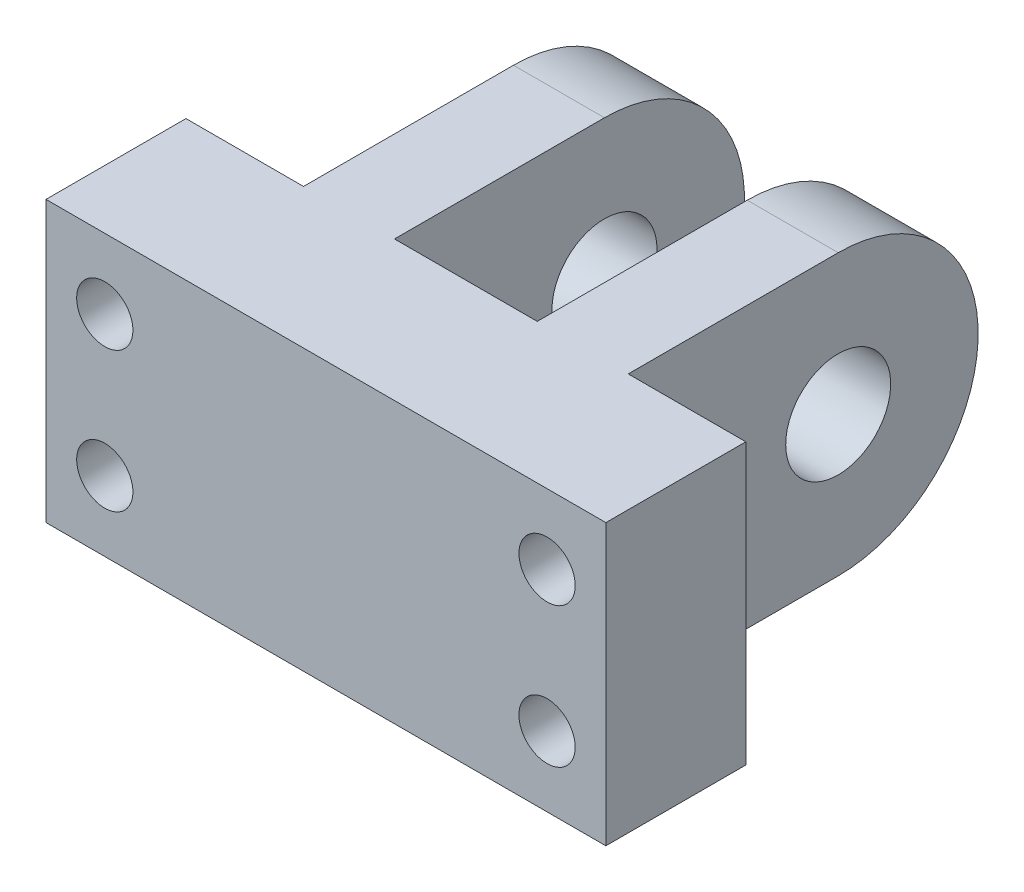
ISO-10303-21;
HEADER;
FILE_DESCRIPTION(('STEP AP214'),'2;1');
FILE_NAME('part.step','',(''),(''),'','','');
FILE_SCHEMA(('AUTOMOTIVE_DESIGN { 1 0 10303 214 1 1 1 1 }'));
ENDSEC;
DATA;
#1=APPLICATION_CONTEXT('core data for automotive mechanical design processes');
#2=APPLICATION_PROTOCOL_DEFINITION('international standard','automotive_design',2000,#1);
#3=PRODUCT_CONTEXT('',#1,'mechanical');
#4=PRODUCT('Part','Part','',(#3));
#5=PRODUCT_RELATED_PRODUCT_CATEGORY('part','',(#4));
#6=PRODUCT_DEFINITION_FORMATION('','',#4);
#7=PRODUCT_DEFINITION_CONTEXT('part definition',#1,'design');
#8=PRODUCT_DEFINITION('design','',#6,#7);
#9=PRODUCT_DEFINITION_SHAPE('','',#8);
#10=(LENGTH_UNIT() NAMED_UNIT(*) SI_UNIT(.MILLI.,.METRE.));
#11=(NAMED_UNIT(*) PLANE_ANGLE_UNIT() SI_UNIT($,.RADIAN.));
#12=(NAMED_UNIT(*) SI_UNIT($,.STERADIAN.) SOLID_ANGLE_UNIT());
#13=UNCERTAINTY_MEASURE_WITH_UNIT(LENGTH_MEASURE(1.E-05),#10,'distance_accuracy_value','');
#14=(GEOMETRIC_REPRESENTATION_CONTEXT(3) GLOBAL_UNCERTAINTY_ASSIGNED_CONTEXT((#13)) GLOBAL_UNIT_ASSIGNED_CONTEXT((#10,
#11,#12)) REPRESENTATION_CONTEXT('',''));
#15=CARTESIAN_POINT('',(0.,0.,0.));
#16=DIRECTION('',(0.,0.,1.));
#17=DIRECTION('',(1.,0.,0.));
#18=AXIS2_PLACEMENT_3D('',#15,#16,#17);
#19=CARTESIAN_POINT('',(50.8,12.7,-31.75));
#20=DIRECTION('',(-1.,0.,0.));
#21=DIRECTION('',(0.,0.,1.));
#22=AXIS2_PLACEMENT_3D('',#19,#20,#21);
#23=CYLINDRICAL_SURFACE('',#22,12.7);
#24=DIRECTION('',(-1.,0.,0.));
#25=VECTOR('',#24,1.);
#26=CARTESIAN_POINT('',(50.8,0.,-31.75));
#27=LINE('',#26,#25);
#28=CARTESIAN_POINT('',(18.923,0.,-31.75));
#29=VERTEX_POINT('',#28);
#30=CARTESIAN_POINT('',(10.668,0.,-31.75));
#31=VERTEX_POINT('',#30);
#32=EDGE_CURVE('E170',#29,#31,#27,.T.);
#33=ORIENTED_EDGE('',*,*,#32,.T.);
#34=CARTESIAN_POINT('',(10.668,12.7,-31.75));
#35=DIRECTION('',(1.,0.,0.));
#36=DIRECTION('',(0.,0.,-1.));
#37=AXIS2_PLACEMENT_3D('',#34,#35,#36);
#38=CIRCLE('',#37,12.7);
#39=CARTESIAN_POINT('',(10.668,25.4,-31.75));
#40=VERTEX_POINT('',#39);
#41=EDGE_CURVE('E162',#31,#40,#38,.T.);
#42=ORIENTED_EDGE('',*,*,#41,.T.);
#43=DIRECTION('',(-1.,0.,0.));
#44=VECTOR('',#43,1.);
#45=CARTESIAN_POINT('',(50.8,25.4,-31.75));
#46=LINE('',#45,#44);
#47=CARTESIAN_POINT('',(18.923,25.4,-31.75));
#48=VERTEX_POINT('',#47);
#49=EDGE_CURVE('E152',#48,#40,#46,.T.);
#50=ORIENTED_EDGE('',*,*,#49,.F.);
#51=CARTESIAN_POINT('',(18.923,12.7,-31.75));
#52=DIRECTION('',(-1.,0.,0.));
#53=DIRECTION('',(0.,0.,1.));
#54=AXIS2_PLACEMENT_3D('',#51,#52,#53);
#55=CIRCLE('',#54,12.7);
#56=EDGE_CURVE('E183',#48,#29,#55,.T.);
#57=ORIENTED_EDGE('',*,*,#56,.T.);
#58=EDGE_LOOP('',(#33,#42,#50,#57));
#59=FACE_BOUND('',#58,.T.);
#60=ADVANCED_FACE('F32',(#59),#23,.T.);
#61=CARTESIAN_POINT('',(50.8,12.7,-31.75));
#62=DIRECTION('',(-1.,0.,0.));
#63=DIRECTION('',(0.,0.,1.));
#64=AXIS2_PLACEMENT_3D('',#61,#62,#63);
#65=PLANE('',#64);
#66=DIRECTION('',(0.,0.,-1.));
#67=VECTOR('',#66,1.);
#68=CARTESIAN_POINT('',(50.8,0.,0.));
#69=LINE('',#68,#67);
#70=CARTESIAN_POINT('',(50.8,0.,0.));
#71=VERTEX_POINT('',#70);
#72=CARTESIAN_POINT('',(50.8,0.,-12.7));
#73=VERTEX_POINT('',#72);
#74=EDGE_CURVE('E144',#71,#73,#69,.T.);
#75=ORIENTED_EDGE('',*,*,#74,.T.);
#76=DIRECTION('',(0.,-1.,0.));
#77=VECTOR('',#76,1.);
#78=CARTESIAN_POINT('',(50.8,25.4,-12.7));
#79=LINE('',#78,#77);
#80=CARTESIAN_POINT('',(50.8,25.4,-12.7));
#81=VERTEX_POINT('',#80);
#82=EDGE_CURVE('E129',#81,#73,#79,.T.);
#83=ORIENTED_EDGE('',*,*,#82,.F.);
#84=DIRECTION('',(0.,0.,1.));
#85=VECTOR('',#84,1.);
#86=CARTESIAN_POINT('',(50.8,25.4,0.));
#87=LINE('',#86,#85);
#88=CARTESIAN_POINT('',(50.8,25.4,0.));
#89=VERTEX_POINT('',#88);
#90=EDGE_CURVE('E142',#81,#89,#87,.T.);
#91=ORIENTED_EDGE('',*,*,#90,.T.);
#92=DIRECTION('',(0.,-1.,0.));
#93=VECTOR('',#92,1.);
#94=CARTESIAN_POINT('',(50.8,0.,0.));
#95=LINE('',#94,#93);
#96=EDGE_CURVE('E154',#89,#71,#95,.T.);
#97=ORIENTED_EDGE('',*,*,#96,.T.);
#98=EDGE_LOOP('',(#75,#83,#91,#97));
#99=FACE_BOUND('',#98,.T.);
#100=ADVANCED_FACE('F140',(#99),#65,.F.);
#101=CARTESIAN_POINT('',(0.,12.7,-31.75));
#102=DIRECTION('',(-1.,0.,0.));
#103=DIRECTION('',(0.,0.,1.));
#104=AXIS2_PLACEMENT_3D('',#101,#102,#103);
#105=PLANE('',#104);
#106=DIRECTION('',(0.,-1.,0.));
#107=VECTOR('',#106,1.);
#108=CARTESIAN_POINT('',(0.,25.4,-12.7));
#109=LINE('',#108,#107);
#110=CARTESIAN_POINT('',(0.,25.4,-12.7));
#111=VERTEX_POINT('',#110);
#112=CARTESIAN_POINT('',(0.,0.,-12.7));
#113=VERTEX_POINT('',#112);
#114=EDGE_CURVE('E177',#111,#113,#109,.T.);
#115=ORIENTED_EDGE('',*,*,#114,.T.);
#116=DIRECTION('',(0.,0.,-1.));
#117=VECTOR('',#116,1.);
#118=CARTESIAN_POINT('',(0.,0.,0.));
#119=LINE('',#118,#117);
#120=CARTESIAN_POINT('',(0.,0.,0.));
#121=VERTEX_POINT('',#120);
#122=EDGE_CURVE('E161',#121,#113,#119,.T.);
#123=ORIENTED_EDGE('',*,*,#122,.F.);
#124=DIRECTION('',(0.,-1.,0.));
#125=VECTOR('',#124,1.);
#126=CARTESIAN_POINT('',(0.,0.,0.));
#127=LINE('',#126,#125);
#128=CARTESIAN_POINT('',(0.,25.4,0.));
#129=VERTEX_POINT('',#128);
#130=EDGE_CURVE('E158',#129,#121,#127,.T.);
#131=ORIENTED_EDGE('',*,*,#130,.F.);
#132=DIRECTION('',(0.,0.,1.));
#133=VECTOR('',#132,1.);
#134=CARTESIAN_POINT('',(0.,25.4,0.));
#135=LINE('',#134,#133);
#136=EDGE_CURVE('E165',#111,#129,#135,.T.);
#137=ORIENTED_EDGE('',*,*,#136,.F.);
#138=EDGE_LOOP('',(#115,#123,#131,#137));
#139=FACE_BOUND('',#138,.T.);
#140=ADVANCED_FACE('F248',(#139),#105,.T.);
#141=CARTESIAN_POINT('',(50.8,0.,0.));
#142=DIRECTION('',(0.,0.,-1.));
#143=DIRECTION('',(-1.,0.,0.));
#144=AXIS2_PLACEMENT_3D('',#141,#142,#143);
#145=PLANE('',#144);
#146=CARTESIAN_POINT('',(45.466,6.34999999999999,0.));
#147=DIRECTION('',(0.,0.,-1.));
#148=DIRECTION('',(0.,1.,0.));
#149=AXIS2_PLACEMENT_3D('',#146,#147,#148);
#150=CIRCLE('',#149,2.5527);
#151=CARTESIAN_POINT('',(45.466,8.90269999999999,0.));
#152=VERTEX_POINT('',#151);
#153=EDGE_CURVE('E369',#152,#152,#150,.T.);
#154=ORIENTED_EDGE('',*,*,#153,.T.);
#155=EDGE_LOOP('',(#154));
#156=FACE_BOUND('',#155,.T.);
#157=CARTESIAN_POINT('',(45.466,19.05,0.));
#158=DIRECTION('',(0.,0.,-1.));
#159=DIRECTION('',(0.,1.,0.));
#160=AXIS2_PLACEMENT_3D('',#157,#158,#159);
#161=CIRCLE('',#160,2.5527);
#162=CARTESIAN_POINT('',(45.466,21.6027,0.));
#163=VERTEX_POINT('',#162);
#164=EDGE_CURVE('E381',#163,#163,#161,.T.);
#165=ORIENTED_EDGE('',*,*,#164,.T.);
#166=EDGE_LOOP('',(#165));
#167=FACE_BOUND('',#166,.T.);
#168=CARTESIAN_POINT('',(5.334,19.05,0.));
#169=DIRECTION('',(0.,0.,-1.));
#170=DIRECTION('',(0.,1.,0.));
#171=AXIS2_PLACEMENT_3D('',#168,#169,#170);
#172=CIRCLE('',#171,2.5527);
#173=CARTESIAN_POINT('',(5.334,21.6027,0.));
#174=VERTEX_POINT('',#173);
#175=EDGE_CURVE('E393',#174,#174,#172,.T.);
#176=ORIENTED_EDGE('',*,*,#175,.T.);
#177=EDGE_LOOP('',(#176));
#178=FACE_BOUND('',#177,.T.);
#179=CARTESIAN_POINT('',(5.334,6.35,0.));
#180=DIRECTION('',(0.,0.,-1.));
#181=DIRECTION('',(0.,1.,0.));
#182=AXIS2_PLACEMENT_3D('',#179,#180,#181);
#183=CIRCLE('',#182,2.5527);
#184=CARTESIAN_POINT('',(5.334,8.9027,0.));
#185=VERTEX_POINT('',#184);
#186=EDGE_CURVE('E205',#185,#185,#183,.T.);
#187=ORIENTED_EDGE('',*,*,#186,.T.);
#188=EDGE_LOOP('',(#187));
#189=FACE_BOUND('',#188,.T.);
#190=ORIENTED_EDGE('',*,*,#130,.T.);
#191=DIRECTION('',(-1.,0.,0.));
#192=VECTOR('',#191,1.);
#193=CARTESIAN_POINT('',(50.8,0.,0.));
#194=LINE('',#193,#192);
#195=EDGE_CURVE('E11',#71,#121,#194,.T.);
#196=ORIENTED_EDGE('',*,*,#195,.F.);
#197=ORIENTED_EDGE('',*,*,#96,.F.);
#198=DIRECTION('',(-1.,0.,0.));
#199=VECTOR('',#198,1.);
#200=CARTESIAN_POINT('',(50.8,25.4,0.));
#201=LINE('',#200,#199);
#202=EDGE_CURVE('E149',#89,#129,#201,.T.);
#203=ORIENTED_EDGE('',*,*,#202,.T.);
#204=EDGE_LOOP('',(#190,#196,#197,#203));
#205=FACE_BOUND('',#204,.T.);
#206=ADVANCED_FACE('F34',(#156,#167,#178,#189,#205),#145,.F.);
#207=CARTESIAN_POINT('',(50.8,0.,0.));
#208=DIRECTION('',(0.,1.,0.));
#209=DIRECTION('',(0.,0.,1.));
#210=AXIS2_PLACEMENT_3D('',#207,#208,#209);
#211=PLANE('',#210);
#212=ORIENTED_EDGE('',*,*,#122,.T.);
#213=DIRECTION('',(-1.,0.,0.));
#214=VECTOR('',#213,1.);
#215=CARTESIAN_POINT('',(10.668,0.,-12.7));
#216=LINE('',#215,#214);
#217=CARTESIAN_POINT('',(10.668,0.,-12.7));
#218=VERTEX_POINT('',#217);
#219=EDGE_CURVE('E136',#218,#113,#216,.T.);
#220=ORIENTED_EDGE('',*,*,#219,.F.);
#221=DIRECTION('',(0.,0.,1.));
#222=VECTOR('',#221,1.);
#223=CARTESIAN_POINT('',(10.668,0.,-44.45));
#224=LINE('',#223,#222);
#225=EDGE_CURVE('E222',#31,#218,#224,.T.);
#226=ORIENTED_EDGE('',*,*,#225,.F.);
#227=ORIENTED_EDGE('',*,*,#32,.F.);
#228=DIRECTION('',(0.,0.,-1.));
#229=VECTOR('',#228,1.);
#230=CARTESIAN_POINT('',(18.923,0.,-12.7));
#231=LINE('',#230,#229);
#232=CARTESIAN_POINT('',(18.923,0.,-12.7));
#233=VERTEX_POINT('',#232);
#234=EDGE_CURVE('E219',#233,#29,#231,.T.);
#235=ORIENTED_EDGE('',*,*,#234,.F.);
#236=DIRECTION('',(-1.,0.,0.));
#237=VECTOR('',#236,1.);
#238=CARTESIAN_POINT('',(31.877,0.,-12.7));
#239=LINE('',#238,#237);
#240=CARTESIAN_POINT('',(31.877,0.,-12.7));
#241=VERTEX_POINT('',#240);
#242=EDGE_CURVE('E216',#241,#233,#239,.T.);
#243=ORIENTED_EDGE('',*,*,#242,.F.);
#244=DIRECTION('',(0.,0.,1.));
#245=VECTOR('',#244,1.);
#246=CARTESIAN_POINT('',(31.877,0.,-44.45));
#247=LINE('',#246,#245);
#248=CARTESIAN_POINT('',(31.877,0.,-31.75));
#249=VERTEX_POINT('',#248);
#250=EDGE_CURVE('E207',#249,#241,#247,.T.);
#251=ORIENTED_EDGE('',*,*,#250,.F.);
#252=CARTESIAN_POINT('',(40.132,0.,-31.75));
#253=VERTEX_POINT('',#252);
#254=EDGE_CURVE('E41',#253,#249,#27,.T.);
#255=ORIENTED_EDGE('',*,*,#254,.F.);
#256=DIRECTION('',(0.,0.,-1.));
#257=VECTOR('',#256,1.);
#258=CARTESIAN_POINT('',(40.132,0.,-12.7));
#259=LINE('',#258,#257);
#260=CARTESIAN_POINT('',(40.132,0.,-12.7));
#261=VERTEX_POINT('',#260);
#262=EDGE_CURVE('E204',#261,#253,#259,.T.);
#263=ORIENTED_EDGE('',*,*,#262,.F.);
#264=DIRECTION('',(-1.,0.,0.));
#265=VECTOR('',#264,1.);
#266=CARTESIAN_POINT('',(50.8,0.,-12.7));
#267=LINE('',#266,#265);
#268=EDGE_CURVE('E201',#73,#261,#267,.T.);
#269=ORIENTED_EDGE('',*,*,#268,.F.);
#270=ORIENTED_EDGE('',*,*,#74,.F.);
#271=ORIENTED_EDGE('',*,*,#195,.T.);
#272=EDGE_LOOP('',(#212,#220,#226,#227,#235,#243,#251,#255,#263,#269,#270,#271));
#273=FACE_BOUND('',#272,.T.);
#274=ADVANCED_FACE('F198',(#273),#211,.F.);
#275=ORIENTED_EDGE('',*,*,#254,.T.);
#276=CARTESIAN_POINT('',(31.877,12.7,-31.75));
#277=DIRECTION('',(1.,0.,0.));
#278=DIRECTION('',(0.,0.,-1.));
#279=AXIS2_PLACEMENT_3D('',#276,#277,#278);
#280=CIRCLE('',#279,12.7);
#281=CARTESIAN_POINT('',(31.877,25.4,-31.75));
#282=VERTEX_POINT('',#281);
#283=EDGE_CURVE('E180',#249,#282,#280,.T.);
#284=ORIENTED_EDGE('',*,*,#283,.T.);
#285=CARTESIAN_POINT('',(40.132,25.4,-31.75));
#286=VERTEX_POINT('',#285);
#287=EDGE_CURVE('E169',#286,#282,#46,.T.);
#288=ORIENTED_EDGE('',*,*,#287,.F.);
#289=CARTESIAN_POINT('',(40.132,12.7,-31.75));
#290=DIRECTION('',(-1.,0.,0.));
#291=DIRECTION('',(0.,0.,1.));
#292=AXIS2_PLACEMENT_3D('',#289,#290,#291);
#293=CIRCLE('',#292,12.7);
#294=EDGE_CURVE('E176',#286,#253,#293,.T.);
#295=ORIENTED_EDGE('',*,*,#294,.T.);
#296=EDGE_LOOP('',(#275,#284,#288,#295));
#297=FACE_BOUND('',#296,.T.);
#298=ADVANCED_FACE('F264',(#297),#23,.T.);
#299=CARTESIAN_POINT('',(50.8,25.4,0.));
#300=DIRECTION('',(0.,-1.,0.));
#301=DIRECTION('',(0.,0.,-1.));
#302=AXIS2_PLACEMENT_3D('',#299,#300,#301);
#303=PLANE('',#302);
#304=DIRECTION('',(0.,0.,1.));
#305=VECTOR('',#304,1.);
#306=CARTESIAN_POINT('',(10.668,25.4,-44.45));
#307=LINE('',#306,#305);
#308=CARTESIAN_POINT('',(10.668,25.4,-12.7));
#309=VERTEX_POINT('',#308);
#310=EDGE_CURVE('E244',#40,#309,#307,.T.);
#311=ORIENTED_EDGE('',*,*,#310,.T.);
#312=DIRECTION('',(-1.,0.,0.));
#313=VECTOR('',#312,1.);
#314=CARTESIAN_POINT('',(10.668,25.4,-12.7));
#315=LINE('',#314,#313);
#316=EDGE_CURVE('E49',#309,#111,#315,.T.);
#317=ORIENTED_EDGE('',*,*,#316,.T.);
#318=ORIENTED_EDGE('',*,*,#136,.T.);
#319=ORIENTED_EDGE('',*,*,#202,.F.);
#320=ORIENTED_EDGE('',*,*,#90,.F.);
#321=DIRECTION('',(-1.,0.,0.));
#322=VECTOR('',#321,1.);
#323=CARTESIAN_POINT('',(50.8,25.4,-12.7));
#324=LINE('',#323,#322);
#325=CARTESIAN_POINT('',(40.132,25.4,-12.7));
#326=VERTEX_POINT('',#325);
#327=EDGE_CURVE('E125',#81,#326,#324,.T.);
#328=ORIENTED_EDGE('',*,*,#327,.T.);
#329=DIRECTION('',(0.,0.,-1.));
#330=VECTOR('',#329,1.);
#331=CARTESIAN_POINT('',(40.132,25.4,-12.7));
#332=LINE('',#331,#330);
#333=EDGE_CURVE('E135',#326,#286,#332,.T.);
#334=ORIENTED_EDGE('',*,*,#333,.T.);
#335=ORIENTED_EDGE('',*,*,#287,.T.);
#336=DIRECTION('',(0.,0.,1.));
#337=VECTOR('',#336,1.);
#338=CARTESIAN_POINT('',(31.877,25.4,-44.45));
#339=LINE('',#338,#337);
#340=CARTESIAN_POINT('',(31.877,25.4,-12.7));
#341=VERTEX_POINT('',#340);
#342=EDGE_CURVE('E236',#282,#341,#339,.T.);
#343=ORIENTED_EDGE('',*,*,#342,.T.);
#344=DIRECTION('',(-1.,0.,0.));
#345=VECTOR('',#344,1.);
#346=CARTESIAN_POINT('',(31.877,25.4,-12.7));
#347=LINE('',#346,#345);
#348=CARTESIAN_POINT('',(18.923,25.4,-12.7));
#349=VERTEX_POINT('',#348);
#350=EDGE_CURVE('E57',#341,#349,#347,.T.);
#351=ORIENTED_EDGE('',*,*,#350,.T.);
#352=DIRECTION('',(0.,0.,-1.));
#353=VECTOR('',#352,1.);
#354=CARTESIAN_POINT('',(18.923,25.4,-12.7));
#355=LINE('',#354,#353);
#356=EDGE_CURVE('E242',#349,#48,#355,.T.);
#357=ORIENTED_EDGE('',*,*,#356,.T.);
#358=ORIENTED_EDGE('',*,*,#49,.T.);
#359=EDGE_LOOP('',(#311,#317,#318,#319,#320,#328,#334,#335,#343,#351,#357,#358));
#360=FACE_BOUND('',#359,.T.);
#361=ADVANCED_FACE('F147',(#360),#303,.F.);
#362=CARTESIAN_POINT('',(40.132,25.4,-12.7));
#363=DIRECTION('',(-1.,0.,0.));
#364=DIRECTION('',(0.,0.,1.));
#365=AXIS2_PLACEMENT_3D('',#362,#363,#364);
#366=PLANE('',#365);
#367=CARTESIAN_POINT('',(40.132,12.7,-31.75));
#368=DIRECTION('',(-1.,0.,0.));
#369=DIRECTION('',(0.,0.,1.));
#370=AXIS2_PLACEMENT_3D('',#367,#368,#369);
#371=CIRCLE('',#370,4.7625);
#372=CARTESIAN_POINT('',(40.132,12.7,-26.9875));
#373=VERTEX_POINT('',#372);
#374=EDGE_CURVE('E173',#373,#373,#371,.T.);
#375=ORIENTED_EDGE('',*,*,#374,.T.);
#376=EDGE_LOOP('',(#375));
#377=FACE_BOUND('',#376,.T.);
#378=ORIENTED_EDGE('',*,*,#333,.F.);
#379=DIRECTION('',(0.,-1.,0.));
#380=VECTOR('',#379,1.);
#381=CARTESIAN_POINT('',(40.132,25.4,-12.7));
#382=LINE('',#381,#380);
#383=EDGE_CURVE('E131',#326,#261,#382,.T.);
#384=ORIENTED_EDGE('',*,*,#383,.T.);
#385=ORIENTED_EDGE('',*,*,#262,.T.);
#386=ORIENTED_EDGE('',*,*,#294,.F.);
#387=EDGE_LOOP('',(#378,#384,#385,#386));
#388=FACE_BOUND('',#387,.T.);
#389=ADVANCED_FACE('F234',(#377,#388),#366,.F.);
#390=CARTESIAN_POINT('',(50.8,25.4,-12.7));
#391=DIRECTION('',(0.,0.,1.));
#392=DIRECTION('',(0.,-1.,0.));
#393=AXIS2_PLACEMENT_3D('',#390,#391,#392);
#394=PLANE('',#393);
#395=CARTESIAN_POINT('',(45.466,6.34999999999999,-12.7));
#396=DIRECTION('',(0.,0.,-1.));
#397=DIRECTION('',(0.,1.,0.));
#398=AXIS2_PLACEMENT_3D('',#395,#396,#397);
#399=CIRCLE('',#398,4.7625);
#400=CARTESIAN_POINT('',(45.466,11.1125,-12.7));
#401=VERTEX_POINT('',#400);
#402=EDGE_CURVE('E362',#401,#401,#399,.T.);
#403=ORIENTED_EDGE('',*,*,#402,.F.);
#404=EDGE_LOOP('',(#403));
#405=FACE_BOUND('',#404,.T.);
#406=CARTESIAN_POINT('',(45.466,19.05,-12.7));
#407=DIRECTION('',(0.,0.,-1.));
#408=DIRECTION('',(0.,1.,0.));
#409=AXIS2_PLACEMENT_3D('',#406,#407,#408);
#410=CIRCLE('',#409,4.7625);
#411=CARTESIAN_POINT('',(45.466,23.8125,-12.7));
#412=VERTEX_POINT('',#411);
#413=EDGE_CURVE('E372',#412,#412,#410,.T.);
#414=ORIENTED_EDGE('',*,*,#413,.F.);
#415=EDGE_LOOP('',(#414));
#416=FACE_BOUND('',#415,.T.);
#417=ORIENTED_EDGE('',*,*,#268,.T.);
#418=ORIENTED_EDGE('',*,*,#383,.F.);
#419=ORIENTED_EDGE('',*,*,#327,.F.);
#420=ORIENTED_EDGE('',*,*,#82,.T.);
#421=EDGE_LOOP('',(#417,#418,#419,#420));
#422=FACE_BOUND('',#421,.T.);
#423=ADVANCED_FACE('F128',(#405,#416,#422),#394,.F.);
#424=CARTESIAN_POINT('',(18.923,25.4,-12.7));
#425=DIRECTION('',(-1.,0.,0.));
#426=DIRECTION('',(0.,0.,1.));
#427=AXIS2_PLACEMENT_3D('',#424,#425,#426);
#428=PLANE('',#427);
#429=CARTESIAN_POINT('',(18.923,12.7,-31.75));
#430=DIRECTION('',(-1.,0.,0.));
#431=DIRECTION('',(0.,0.,1.));
#432=AXIS2_PLACEMENT_3D('',#429,#430,#431);
#433=CIRCLE('',#432,4.7625);
#434=CARTESIAN_POINT('',(18.923,12.7,-26.9875));
#435=VERTEX_POINT('',#434);
#436=EDGE_CURVE('E181',#435,#435,#433,.T.);
#437=ORIENTED_EDGE('',*,*,#436,.T.);
#438=EDGE_LOOP('',(#437));
#439=FACE_BOUND('',#438,.T.);
#440=ORIENTED_EDGE('',*,*,#356,.F.);
#441=DIRECTION('',(0.,-1.,0.));
#442=VECTOR('',#441,1.);
#443=CARTESIAN_POINT('',(18.923,25.4,-12.7));
#444=LINE('',#443,#442);
#445=EDGE_CURVE('E229',#349,#233,#444,.T.);
#446=ORIENTED_EDGE('',*,*,#445,.T.);
#447=ORIENTED_EDGE('',*,*,#234,.T.);
#448=ORIENTED_EDGE('',*,*,#56,.F.);
#449=EDGE_LOOP('',(#440,#446,#447,#448));
#450=FACE_BOUND('',#449,.T.);
#451=ADVANCED_FACE('F258',(#439,#450),#428,.F.);
#452=CARTESIAN_POINT('',(31.877,25.4,-44.45));
#453=DIRECTION('',(1.,0.,0.));
#454=DIRECTION('',(0.,0.,-1.));
#455=AXIS2_PLACEMENT_3D('',#452,#453,#454);
#456=PLANE('',#455);
#457=CARTESIAN_POINT('',(31.877,12.7,-31.75));
#458=DIRECTION('',(1.,0.,0.));
#459=DIRECTION('',(0.,0.,-1.));
#460=AXIS2_PLACEMENT_3D('',#457,#458,#459);
#461=CIRCLE('',#460,4.7625);
#462=CARTESIAN_POINT('',(31.877,12.7,-36.5125));
#463=VERTEX_POINT('',#462);
#464=EDGE_CURVE('E178',#463,#463,#461,.T.);
#465=ORIENTED_EDGE('',*,*,#464,.T.);
#466=EDGE_LOOP('',(#465));
#467=FACE_BOUND('',#466,.T.);
#468=ORIENTED_EDGE('',*,*,#283,.F.);
#469=ORIENTED_EDGE('',*,*,#250,.T.);
#470=DIRECTION('',(0.,-1.,0.));
#471=VECTOR('',#470,1.);
#472=CARTESIAN_POINT('',(31.877,25.4,-12.7));
#473=LINE('',#472,#471);
#474=EDGE_CURVE('E231',#341,#241,#473,.T.);
#475=ORIENTED_EDGE('',*,*,#474,.F.);
#476=ORIENTED_EDGE('',*,*,#342,.F.);
#477=EDGE_LOOP('',(#468,#469,#475,#476));
#478=FACE_BOUND('',#477,.T.);
#479=ADVANCED_FACE('F263',(#467,#478),#456,.F.);
#480=CARTESIAN_POINT('',(31.877,25.4,-12.7));
#481=DIRECTION('',(0.,0.,1.));
#482=DIRECTION('',(0.,-1.,0.));
#483=AXIS2_PLACEMENT_3D('',#480,#481,#482);
#484=PLANE('',#483);
#485=ORIENTED_EDGE('',*,*,#242,.T.);
#486=ORIENTED_EDGE('',*,*,#445,.F.);
#487=ORIENTED_EDGE('',*,*,#350,.F.);
#488=ORIENTED_EDGE('',*,*,#474,.T.);
#489=EDGE_LOOP('',(#485,#486,#487,#488));
#490=FACE_BOUND('',#489,.T.);
#491=ADVANCED_FACE('F261',(#490),#484,.F.);
#492=CARTESIAN_POINT('',(50.8,12.7,-31.75));
#493=DIRECTION('',(-1.,0.,0.));
#494=DIRECTION('',(0.,0.,1.));
#495=AXIS2_PLACEMENT_3D('',#492,#493,#494);
#496=CYLINDRICAL_SURFACE('',#495,4.7625);
#497=CARTESIAN_POINT('',(10.668,12.7,-31.75));
#498=DIRECTION('',(1.,0.,0.));
#499=DIRECTION('',(0.,0.,-1.));
#500=AXIS2_PLACEMENT_3D('',#497,#498,#499);
#501=CIRCLE('',#500,4.7625);
#502=CARTESIAN_POINT('',(10.668,12.7,-36.5125));
#503=VERTEX_POINT('',#502);
#504=EDGE_CURVE('E36',#503,#503,#501,.T.);
#505=ORIENTED_EDGE('',*,*,#504,.F.);
#506=EDGE_LOOP('',(#505));
#507=FACE_BOUND('',#506,.T.);
#508=ORIENTED_EDGE('',*,*,#436,.F.);
#509=EDGE_LOOP('',(#508));
#510=FACE_BOUND('',#509,.T.);
#511=ADVANCED_FACE('F287',(#507,#510),#496,.F.);
#512=CARTESIAN_POINT('',(10.668,25.4,-44.45));
#513=DIRECTION('',(1.,0.,0.));
#514=DIRECTION('',(0.,0.,-1.));
#515=AXIS2_PLACEMENT_3D('',#512,#513,#514);
#516=PLANE('',#515);
#517=ORIENTED_EDGE('',*,*,#504,.T.);
#518=EDGE_LOOP('',(#517));
#519=FACE_BOUND('',#518,.T.);
#520=ORIENTED_EDGE('',*,*,#41,.F.);
#521=ORIENTED_EDGE('',*,*,#225,.T.);
#522=DIRECTION('',(0.,-1.,0.));
#523=VECTOR('',#522,1.);
#524=CARTESIAN_POINT('',(10.668,25.4,-12.7));
#525=LINE('',#524,#523);
#526=EDGE_CURVE('E227',#309,#218,#525,.T.);
#527=ORIENTED_EDGE('',*,*,#526,.F.);
#528=ORIENTED_EDGE('',*,*,#310,.F.);
#529=EDGE_LOOP('',(#520,#521,#527,#528));
#530=FACE_BOUND('',#529,.T.);
#531=ADVANCED_FACE('F301',(#519,#530),#516,.F.);
#532=CARTESIAN_POINT('',(10.668,25.4,-12.7));
#533=DIRECTION('',(0.,0.,1.));
#534=DIRECTION('',(0.,-1.,0.));
#535=AXIS2_PLACEMENT_3D('',#532,#533,#534);
#536=PLANE('',#535);
#537=CARTESIAN_POINT('',(5.334,19.05,-12.7));
#538=DIRECTION('',(0.,0.,-1.));
#539=DIRECTION('',(0.,1.,0.));
#540=AXIS2_PLACEMENT_3D('',#537,#538,#539);
#541=CIRCLE('',#540,4.7625);
#542=CARTESIAN_POINT('',(5.334,23.8125,-12.7));
#543=VERTEX_POINT('',#542);
#544=EDGE_CURVE('E384',#543,#543,#541,.T.);
#545=ORIENTED_EDGE('',*,*,#544,.F.);
#546=EDGE_LOOP('',(#545));
#547=FACE_BOUND('',#546,.T.);
#548=CARTESIAN_POINT('',(5.334,6.35,-12.7));
#549=DIRECTION('',(0.,0.,-1.));
#550=DIRECTION('',(0.,1.,0.));
#551=AXIS2_PLACEMENT_3D('',#548,#549,#550);
#552=CIRCLE('',#551,4.7625);
#553=CARTESIAN_POINT('',(5.334,11.1125,-12.7));
#554=VERTEX_POINT('',#553);
#555=EDGE_CURVE('E396',#554,#554,#552,.T.);
#556=ORIENTED_EDGE('',*,*,#555,.F.);
#557=EDGE_LOOP('',(#556));
#558=FACE_BOUND('',#557,.T.);
#559=ORIENTED_EDGE('',*,*,#219,.T.);
#560=ORIENTED_EDGE('',*,*,#114,.F.);
#561=ORIENTED_EDGE('',*,*,#316,.F.);
#562=ORIENTED_EDGE('',*,*,#526,.T.);
#563=EDGE_LOOP('',(#559,#560,#561,#562));
#564=FACE_BOUND('',#563,.T.);
#565=ADVANCED_FACE('F249',(#547,#558,#564),#536,.F.);
#566=ORIENTED_EDGE('',*,*,#464,.F.);
#567=EDGE_LOOP('',(#566));
#568=FACE_BOUND('',#567,.T.);
#569=ORIENTED_EDGE('',*,*,#374,.F.);
#570=EDGE_LOOP('',(#569));
#571=FACE_BOUND('',#570,.T.);
#572=ADVANCED_FACE('F282',(#568,#571),#496,.F.);
#573=CARTESIAN_POINT('',(5.334,6.35,-12.7));
#574=DIRECTION('',(0.,0.,-1.));
#575=DIRECTION('',(0.,1.,0.));
#576=AXIS2_PLACEMENT_3D('',#573,#574,#575);
#577=CYLINDRICAL_SURFACE('',#576,2.5527);
#578=ORIENTED_EDGE('',*,*,#186,.F.);
#579=EDGE_LOOP('',(#578));
#580=FACE_BOUND('',#579,.T.);
#581=CARTESIAN_POINT('',(5.334,6.35,-7.874));
#582=DIRECTION('',(0.,0.,-1.));
#583=DIRECTION('',(0.,1.,0.));
#584=AXIS2_PLACEMENT_3D('',#581,#582,#583);
#585=CIRCLE('',#584,2.5527);
#586=CARTESIAN_POINT('',(5.334,8.9027,-7.874));
#587=VERTEX_POINT('',#586);
#588=EDGE_CURVE('E210',#587,#587,#585,.T.);
#589=ORIENTED_EDGE('',*,*,#588,.T.);
#590=EDGE_LOOP('',(#589));
#591=FACE_BOUND('',#590,.T.);
#592=ADVANCED_FACE('F285',(#580,#591),#577,.F.);
#593=CARTESIAN_POINT('',(7.8867,6.35,-7.874));
#594=DIRECTION('',(0.,0.,1.));
#595=DIRECTION('',(0.,-1.,0.));
#596=AXIS2_PLACEMENT_3D('',#593,#594,#595);
#597=PLANE('',#596);
#598=ORIENTED_EDGE('',*,*,#588,.F.);
#599=EDGE_LOOP('',(#598));
#600=FACE_BOUND('',#599,.T.);
#601=CARTESIAN_POINT('',(5.334,6.35,-7.874));
#602=DIRECTION('',(0.,0.,-1.));
#603=DIRECTION('',(0.,1.,0.));
#604=AXIS2_PLACEMENT_3D('',#601,#602,#603);
#605=CIRCLE('',#604,4.7625);
#606=CARTESIAN_POINT('',(5.334,11.1125,-7.874));
#607=VERTEX_POINT('',#606);
#608=EDGE_CURVE('E399',#607,#607,#605,.T.);
#609=ORIENTED_EDGE('',*,*,#608,.T.);
#610=EDGE_LOOP('',(#609));
#611=FACE_BOUND('',#610,.T.);
#612=ADVANCED_FACE('F310',(#600,#611),#597,.F.);
#613=CARTESIAN_POINT('',(5.334,6.35,-12.7));
#614=DIRECTION('',(0.,0.,-1.));
#615=DIRECTION('',(0.,1.,0.));
#616=AXIS2_PLACEMENT_3D('',#613,#614,#615);
#617=CYLINDRICAL_SURFACE('',#616,4.7625);
#618=ORIENTED_EDGE('',*,*,#608,.F.);
#619=EDGE_LOOP('',(#618));
#620=FACE_BOUND('',#619,.T.);
#621=ORIENTED_EDGE('',*,*,#555,.T.);
#622=EDGE_LOOP('',(#621));
#623=FACE_BOUND('',#622,.T.);
#624=ADVANCED_FACE('F314',(#620,#623),#617,.F.);
#625=CARTESIAN_POINT('',(5.334,19.05,-12.7));
#626=DIRECTION('',(0.,0.,-1.));
#627=DIRECTION('',(0.,1.,0.));
#628=AXIS2_PLACEMENT_3D('',#625,#626,#627);
#629=CYLINDRICAL_SURFACE('',#628,2.5527);
#630=ORIENTED_EDGE('',*,*,#175,.F.);
#631=EDGE_LOOP('',(#630));
#632=FACE_BOUND('',#631,.T.);
#633=CARTESIAN_POINT('',(5.334,19.05,-7.874));
#634=DIRECTION('',(0.,0.,-1.));
#635=DIRECTION('',(0.,1.,0.));
#636=AXIS2_PLACEMENT_3D('',#633,#634,#635);
#637=CIRCLE('',#636,2.5527);
#638=CARTESIAN_POINT('',(5.334,21.6027,-7.874));
#639=VERTEX_POINT('',#638);
#640=EDGE_CURVE('E390',#639,#639,#637,.T.);
#641=ORIENTED_EDGE('',*,*,#640,.T.);
#642=EDGE_LOOP('',(#641));
#643=FACE_BOUND('',#642,.T.);
#644=ADVANCED_FACE('F318',(#632,#643),#629,.F.);
#645=CARTESIAN_POINT('',(7.8867,19.05,-7.874));
#646=DIRECTION('',(0.,0.,1.));
#647=DIRECTION('',(0.,-1.,0.));
#648=AXIS2_PLACEMENT_3D('',#645,#646,#647);
#649=PLANE('',#648);
#650=ORIENTED_EDGE('',*,*,#640,.F.);
#651=EDGE_LOOP('',(#650));
#652=FACE_BOUND('',#651,.T.);
#653=CARTESIAN_POINT('',(5.334,19.05,-7.874));
#654=DIRECTION('',(0.,0.,-1.));
#655=DIRECTION('',(0.,1.,0.));
#656=AXIS2_PLACEMENT_3D('',#653,#654,#655);
#657=CIRCLE('',#656,4.7625);
#658=CARTESIAN_POINT('',(5.334,23.8125,-7.874));
#659=VERTEX_POINT('',#658);
#660=EDGE_CURVE('E387',#659,#659,#657,.T.);
#661=ORIENTED_EDGE('',*,*,#660,.T.);
#662=EDGE_LOOP('',(#661));
#663=FACE_BOUND('',#662,.T.);
#664=ADVANCED_FACE('F322',(#652,#663),#649,.F.);
#665=CARTESIAN_POINT('',(5.334,19.05,-12.7));
#666=DIRECTION('',(0.,0.,-1.));
#667=DIRECTION('',(0.,1.,0.));
#668=AXIS2_PLACEMENT_3D('',#665,#666,#667);
#669=CYLINDRICAL_SURFACE('',#668,4.7625);
#670=ORIENTED_EDGE('',*,*,#660,.F.);
#671=EDGE_LOOP('',(#670));
#672=FACE_BOUND('',#671,.T.);
#673=ORIENTED_EDGE('',*,*,#544,.T.);
#674=EDGE_LOOP('',(#673));
#675=FACE_BOUND('',#674,.T.);
#676=ADVANCED_FACE('F326',(#672,#675),#669,.F.);
#677=CARTESIAN_POINT('',(45.466,19.05,-12.7));
#678=DIRECTION('',(0.,0.,-1.));
#679=DIRECTION('',(0.,1.,0.));
#680=AXIS2_PLACEMENT_3D('',#677,#678,#679);
#681=CYLINDRICAL_SURFACE('',#680,2.5527);
#682=ORIENTED_EDGE('',*,*,#164,.F.);
#683=EDGE_LOOP('',(#682));
#684=FACE_BOUND('',#683,.T.);
#685=CARTESIAN_POINT('',(45.466,19.05,-7.874));
#686=DIRECTION('',(0.,0.,-1.));
#687=DIRECTION('',(0.,1.,0.));
#688=AXIS2_PLACEMENT_3D('',#685,#686,#687);
#689=CIRCLE('',#688,2.5527);
#690=CARTESIAN_POINT('',(45.466,21.6027,-7.874));
#691=VERTEX_POINT('',#690);
#692=EDGE_CURVE('E378',#691,#691,#689,.T.);
#693=ORIENTED_EDGE('',*,*,#692,.T.);
#694=EDGE_LOOP('',(#693));
#695=FACE_BOUND('',#694,.T.);
#696=ADVANCED_FACE('F330',(#684,#695),#681,.F.);
#697=CARTESIAN_POINT('',(48.0187,19.05,-7.874));
#698=DIRECTION('',(0.,0.,1.));
#699=DIRECTION('',(0.,-1.,0.));
#700=AXIS2_PLACEMENT_3D('',#697,#698,#699);
#701=PLANE('',#700);
#702=ORIENTED_EDGE('',*,*,#692,.F.);
#703=EDGE_LOOP('',(#702));
#704=FACE_BOUND('',#703,.T.);
#705=CARTESIAN_POINT('',(45.466,19.05,-7.874));
#706=DIRECTION('',(0.,0.,-1.));
#707=DIRECTION('',(0.,1.,0.));
#708=AXIS2_PLACEMENT_3D('',#705,#706,#707);
#709=CIRCLE('',#708,4.7625);
#710=CARTESIAN_POINT('',(45.466,23.8125,-7.874));
#711=VERTEX_POINT('',#710);
#712=EDGE_CURVE('E375',#711,#711,#709,.T.);
#713=ORIENTED_EDGE('',*,*,#712,.T.);
#714=EDGE_LOOP('',(#713));
#715=FACE_BOUND('',#714,.T.);
#716=ADVANCED_FACE('F334',(#704,#715),#701,.F.);
#717=CARTESIAN_POINT('',(45.466,19.05,-12.7));
#718=DIRECTION('',(0.,0.,-1.));
#719=DIRECTION('',(0.,1.,0.));
#720=AXIS2_PLACEMENT_3D('',#717,#718,#719);
#721=CYLINDRICAL_SURFACE('',#720,4.7625);
#722=ORIENTED_EDGE('',*,*,#712,.F.);
#723=EDGE_LOOP('',(#722));
#724=FACE_BOUND('',#723,.T.);
#725=ORIENTED_EDGE('',*,*,#413,.T.);
#726=EDGE_LOOP('',(#725));
#727=FACE_BOUND('',#726,.T.);
#728=ADVANCED_FACE('F338',(#724,#727),#721,.F.);
#729=CARTESIAN_POINT('',(45.466,6.34999999999999,-12.7));
#730=DIRECTION('',(0.,0.,-1.));
#731=DIRECTION('',(0.,1.,0.));
#732=AXIS2_PLACEMENT_3D('',#729,#730,#731);
#733=CYLINDRICAL_SURFACE('',#732,2.5527);
#734=ORIENTED_EDGE('',*,*,#153,.F.);
#735=EDGE_LOOP('',(#734));
#736=FACE_BOUND('',#735,.T.);
#737=CARTESIAN_POINT('',(45.466,6.34999999999999,-7.874));
#738=DIRECTION('',(0.,0.,-1.));
#739=DIRECTION('',(0.,1.,0.));
#740=AXIS2_PLACEMENT_3D('',#737,#738,#739);
#741=CIRCLE('',#740,2.5527);
#742=CARTESIAN_POINT('',(45.466,8.90269999999999,-7.874));
#743=VERTEX_POINT('',#742);
#744=EDGE_CURVE('E364',#743,#743,#741,.T.);
#745=ORIENTED_EDGE('',*,*,#744,.T.);
#746=EDGE_LOOP('',(#745));
#747=FACE_BOUND('',#746,.T.);
#748=ADVANCED_FACE('F342',(#736,#747),#733,.F.);
#749=CARTESIAN_POINT('',(48.0187,6.34999999999999,-7.874));
#750=DIRECTION('',(0.,0.,1.));
#751=DIRECTION('',(0.,-1.,0.));
#752=AXIS2_PLACEMENT_3D('',#749,#750,#751);
#753=PLANE('',#752);
#754=ORIENTED_EDGE('',*,*,#744,.F.);
#755=EDGE_LOOP('',(#754));
#756=FACE_BOUND('',#755,.T.);
#757=CARTESIAN_POINT('',(45.466,6.34999999999999,-7.874));
#758=DIRECTION('',(0.,0.,-1.));
#759=DIRECTION('',(0.,1.,0.));
#760=AXIS2_PLACEMENT_3D('',#757,#758,#759);
#761=CIRCLE('',#760,4.7625);
#762=CARTESIAN_POINT('',(45.466,11.1125,-7.874));
#763=VERTEX_POINT('',#762);
#764=EDGE_CURVE('E359',#763,#763,#761,.T.);
#765=ORIENTED_EDGE('',*,*,#764,.T.);
#766=EDGE_LOOP('',(#765));
#767=FACE_BOUND('',#766,.T.);
#768=ADVANCED_FACE('F346',(#756,#767),#753,.F.);
#769=CARTESIAN_POINT('',(45.466,6.34999999999999,-12.7));
#770=DIRECTION('',(0.,0.,-1.));
#771=DIRECTION('',(0.,1.,0.));
#772=AXIS2_PLACEMENT_3D('',#769,#770,#771);
#773=CYLINDRICAL_SURFACE('',#772,4.7625);
#774=ORIENTED_EDGE('',*,*,#764,.F.);
#775=EDGE_LOOP('',(#774));
#776=FACE_BOUND('',#775,.T.);
#777=ORIENTED_EDGE('',*,*,#402,.T.);
#778=EDGE_LOOP('',(#777));
#779=FACE_BOUND('',#778,.T.);
#780=ADVANCED_FACE('F350',(#776,#779),#773,.F.);
#781=CLOSED_SHELL('',(#60,#100,#140,#206,#274,#298,#361,#389,#423,#451,#479,#491,#511,#531,#565,
#572,#592,#612,#624,#644,#664,#676,#696,#716,#728,#748,#768,#780));
#782=MANIFOLD_SOLID_BREP('B2',#781);
#783=ADVANCED_BREP_SHAPE_REPRESENTATION('',(#18,#782),#14);
#784=SHAPE_DEFINITION_REPRESENTATION(#9,#783);
ENDSEC;
END-ISO-10303-21;
